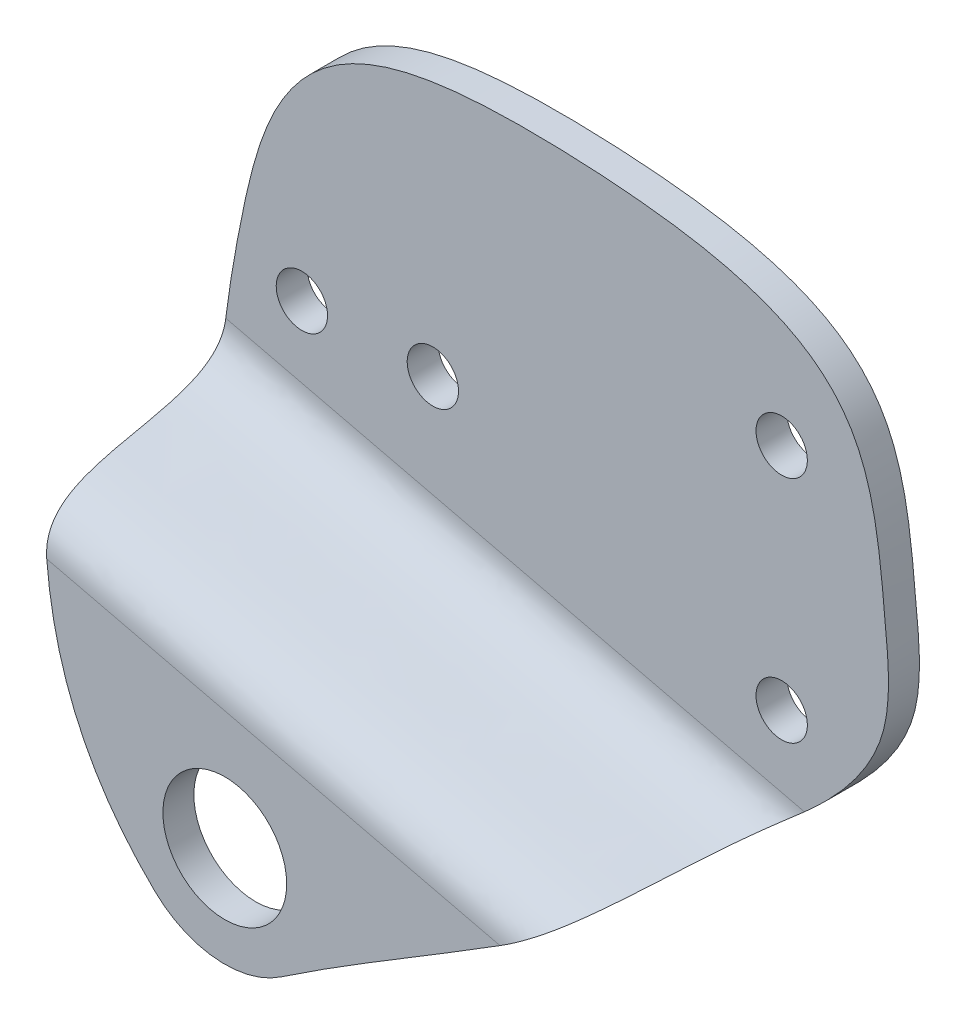
ISO-10303-21;
HEADER;
FILE_DESCRIPTION(('STEP AP214'),'2;1');
FILE_NAME('part.step','',(''),(''),'','','');
FILE_SCHEMA(('AUTOMOTIVE_DESIGN { 1 0 10303 214 1 1 1 1 }'));
ENDSEC;
DATA;
#1=APPLICATION_CONTEXT('core data for automotive mechanical design processes');
#2=APPLICATION_PROTOCOL_DEFINITION('international standard','automotive_design',2000,#1);
#3=PRODUCT_CONTEXT('',#1,'mechanical');
#4=PRODUCT('Part','Part','',(#3));
#5=PRODUCT_RELATED_PRODUCT_CATEGORY('part','',(#4));
#6=PRODUCT_DEFINITION_FORMATION('','',#4);
#7=PRODUCT_DEFINITION_CONTEXT('part definition',#1,'design');
#8=PRODUCT_DEFINITION('design','',#6,#7);
#9=PRODUCT_DEFINITION_SHAPE('','',#8);
#10=(LENGTH_UNIT() NAMED_UNIT(*) SI_UNIT(.MILLI.,.METRE.));
#11=(NAMED_UNIT(*) PLANE_ANGLE_UNIT() SI_UNIT($,.RADIAN.));
#12=(NAMED_UNIT(*) SI_UNIT($,.STERADIAN.) SOLID_ANGLE_UNIT());
#13=UNCERTAINTY_MEASURE_WITH_UNIT(LENGTH_MEASURE(1.E-05),#10,'distance_accuracy_value','');
#14=(GEOMETRIC_REPRESENTATION_CONTEXT(3) GLOBAL_UNCERTAINTY_ASSIGNED_CONTEXT((#13)) GLOBAL_UNIT_ASSIGNED_CONTEXT((#10,
#11,#12)) REPRESENTATION_CONTEXT('',''));
#15=CARTESIAN_POINT('',(0.,0.,0.));
#16=DIRECTION('',(0.,0.,1.));
#17=DIRECTION('',(1.,0.,0.));
#18=AXIS2_PLACEMENT_3D('',#15,#16,#17);
#19=CARTESIAN_POINT('',(-6.75827311296111,-14.3276770365907,20.));
#20=CARTESIAN_POINT('',(-19.8154079035087,-1.77108365191892,20.));
#21=CARTESIAN_POINT('',(-17.8680940726573,18.374574848412,20.));
#22=CARTESIAN_POINT('',(-11.5593956936098,47.1138850064545,20.));
#23=CARTESIAN_POINT('',(0.771302016072701,51.6536949529489,20.));
#24=CARTESIAN_POINT('',(45.1342229676761,49.0484343886684,20.));
#25=CARTESIAN_POINT('',(46.0113162890516,37.2911359933891,20.));
#26=CARTESIAN_POINT('',(48.8462304394248,7.87308757883785,20.));
#27=CARTESIAN_POINT('',(21.9825403796663,-4.18951904205312,20.));
#28=CARTESIAN_POINT('',(5.46679546409183,-15.3732055191096,20.));
#29=B_SPLINE_CURVE_WITH_KNOTS('',3,(#19,#20,#21,#22,#23,#24,#25,#26,#27,#28),.UNSPECIFIED.,.F.,
.F.,(4,1,1,1,1,1,1,4),(0.,0.179468051465904,0.221834172396024,0.401235982978407,
0.455769682109186,0.712637464573034,0.770271343642914,1.),.UNSPECIFIED.);
#30=DIRECTION('',(0.,0.,-1.));
#31=VECTOR('',#30,1.);
#32=SURFACE_OF_LINEAR_EXTRUSION('',#29,#31);
#33=CARTESIAN_POINT('',(-17.1576461110458,7.23100151822922,17.));
#34=CARTESIAN_POINT('',(-17.1600373098258,7.25330435248548,17.0000178031605));
#35=CARTESIAN_POINT('',(-17.162409159117,7.27559563335837,16.998784301204));
#36=CARTESIAN_POINT('',(-17.1670865979264,7.31987833822628,16.9939688079371));
#37=CARTESIAN_POINT('',(-17.1693923308647,7.34187034663965,16.9903923769404));
#38=CARTESIAN_POINT('',(-17.1738786422944,7.38497365658473,16.9811322626733));
#39=CARTESIAN_POINT('',(-17.1760607634072,7.40609374878556,16.9754897332528));
#40=CARTESIAN_POINT('',(-17.1803345080112,7.44774867071633,16.9623127043894));
#41=CARTESIAN_POINT('',(-17.1824260735081,7.46828312259538,16.9547770129257));
#42=CARTESIAN_POINT('',(-17.1897558955757,7.5407409830544,16.9247665724802));
#43=CARTESIAN_POINT('',(-17.1947212157618,7.59077107133713,16.8975600834334));
#44=CARTESIAN_POINT('',(-17.2017077113564,7.6622970911833,16.8512196679418));
#45=CARTESIAN_POINT('',(-17.2039687306374,7.68564943471247,16.8347645100948));
#46=CARTESIAN_POINT('',(-17.2083474143693,7.7312359683866,16.8003423391896));
#47=CARTESIAN_POINT('',(-17.2104650931944,7.75347027059149,16.7823754781321));
#48=CARTESIAN_POINT('',(-17.2177049225561,7.83006798652348,16.7168872024302));
#49=CARTESIAN_POINT('',(-17.2224794962828,7.88167347589056,16.6661119400432));
#50=CARTESIAN_POINT('',(-17.2314112756843,7.97988638193276,16.5598605843504));
#51=CARTESIAN_POINT('',(-17.2355672240998,8.02648356803469,16.5043752682839));
#52=CARTESIAN_POINT('',(-17.2434201274369,8.11598073250213,16.3901219414568));
#53=CARTESIAN_POINT('',(-17.2471151076446,8.15886457887969,16.331341272746));
#54=CARTESIAN_POINT('',(-17.254127264878,8.24153479610629,16.2117344206324));
#55=CARTESIAN_POINT('',(-17.2574448264314,8.28132430625411,16.1509104024346));
#56=CARTESIAN_POINT('',(-17.2652199074282,8.37599407327627,15.9998213174517));
#57=CARTESIAN_POINT('',(-17.2695121926573,8.42953581781948,15.9087126725229));
#58=CARTESIAN_POINT('',(-17.2776265464514,8.53288246050805,15.7243676372868));
#59=CARTESIAN_POINT('',(-17.281448453024,8.58268606899698,15.6311305269958));
#60=CARTESIAN_POINT('',(-17.2887300304185,8.67952948449885,15.4429726097941));
#61=CARTESIAN_POINT('',(-17.2921889086396,8.72656314957593,15.3480486270549));
#62=CARTESIAN_POINT('',(-17.2988059774584,8.81838097573991,15.1571051631543));
#63=CARTESIAN_POINT('',(-17.3019641427025,8.86316494700127,15.0610855903848));
#64=CARTESIAN_POINT('',(-17.3110737703264,8.99495489772294,14.7715985552958));
#65=CARTESIAN_POINT('',(-17.3166526960266,9.0792958453852,14.5769087255384));
#66=CARTESIAN_POINT('',(-17.3270926655446,9.24347587673956,14.1853560817418));
#67=CARTESIAN_POINT('',(-17.3319527795949,9.32330904866101,13.9884908012882));
#68=CARTESIAN_POINT('',(-17.3410958839933,9.47978541883292,13.5938347245058));
#69=CARTESIAN_POINT('',(-17.3453797413679,9.55643328678098,13.3960457925836));
#70=CARTESIAN_POINT('',(-17.3534778935976,9.70770714752569,12.9998061160096));
#71=CARTESIAN_POINT('',(-17.3572924257588,9.78233414712837,12.8013557583671));
#72=CARTESIAN_POINT('',(-17.3644166438383,9.92826798099371,12.4097228711362));
#73=CARTESIAN_POINT('',(-17.367737698625,9.9996085606063,12.2165530844254));
#74=CARTESIAN_POINT('',(-17.3740418972421,10.1417342650718,11.8300034956042));
#75=CARTESIAN_POINT('',(-17.3770250396144,10.2125193875268,11.6366236925912));
#76=CARTESIAN_POINT('',(-17.385513690571,10.424835518141,11.0562359637629));
#77=CARTESIAN_POINT('',(-17.3905548558369,10.5662539206519,10.6691797887427));
#78=CARTESIAN_POINT('',(-17.3995049890679,10.8519346545281,9.89595580643819));
#79=CARTESIAN_POINT('',(-17.4034135899093,10.9961978919055,9.5097883273784));
#80=CARTESIAN_POINT('',(-17.4100743076939,11.2897039103176,8.74081908783941));
#81=CARTESIAN_POINT('',(-17.4128302872911,11.4389282208481,8.35801036403878));
#82=CARTESIAN_POINT('',(-17.4171037021398,11.7454482929611,7.59572705162868));
#83=CARTESIAN_POINT('',(-17.4186214564127,11.9027419644128,7.21625162915467));
#84=CARTESIAN_POINT('',(-17.4202229276538,12.2283588719653,6.46214354195705));
#85=CARTESIAN_POINT('',(-17.4203070936521,12.3966786378779,6.08750939758239));
#86=CARTESIAN_POINT('',(-17.4190568723475,12.6726235692408,5.50447711744415));
#87=CARTESIAN_POINT('',(-17.4183157573985,12.775296353606,5.29373518419097));
#88=CARTESIAN_POINT('',(-17.4161724162553,12.9862744754258,4.87506564584575));
#89=CARTESIAN_POINT('',(-17.4147701526028,13.0945801317086,4.66713820089884));
#90=CARTESIAN_POINT('',(-17.411191080342,13.3180680379784,4.2543059418259));
#91=CARTESIAN_POINT('',(-17.4090122738401,13.4332673819302,4.04941035767673));
#92=CARTESIAN_POINT('',(-17.4037388054737,13.6714403649219,3.64419322599506));
#93=CARTESIAN_POINT('',(-17.4006442014773,13.7944135123591,3.44387139031447));
#94=CARTESIAN_POINT('',(-17.3933206888617,14.0507530398545,3.04724661735366));
#95=CARTESIAN_POINT('',(-17.3890812109081,14.1842076016576,2.85100046882114));
#96=CARTESIAN_POINT('',(-17.3792348641996,14.4622299260666,2.46640324447343));
#97=CARTESIAN_POINT('',(-17.3736274902082,14.6068017813368,2.27805511600767));
#98=CARTESIAN_POINT('',(-17.3607477388921,14.9085662788378,1.9126906588289));
#99=CARTESIAN_POINT('',(-17.3534807002069,15.065717426705,1.73564027578168));
#100=CARTESIAN_POINT('',(-17.3368836804853,15.3950345755347,1.3964112832851));
#101=CARTESIAN_POINT('',(-17.3275558962753,15.5671844698345,1.23421709514214));
#102=CARTESIAN_POINT('',(-17.3061703370653,15.9318454546632,0.927595605025775));
#103=CARTESIAN_POINT('',(-17.2940700975037,16.1246453898254,0.783505224709323));
#104=CARTESIAN_POINT('',(-17.2735853475489,16.4276839525698,0.589406877136833));
#105=CARTESIAN_POINT('',(-17.2663687010225,16.5309944597746,0.528384286401697));
#106=CARTESIAN_POINT('',(-17.2511095070699,16.7420998854735,0.414834662435587));
#107=CARTESIAN_POINT('',(-17.2430674085647,16.8498923476835,0.362303051003599));
#108=CARTESIAN_POINT('',(-17.2271481895412,17.0564086578921,0.272607204825161));
#109=CARTESIAN_POINT('',(-17.2193672181201,17.1546671930775,0.234355121229615));
#110=CARTESIAN_POINT('',(-17.2031513233609,17.3539046098518,0.16604078850934));
#111=CARTESIAN_POINT('',(-17.1947167075721,17.4548821976671,0.135974717440806));
#112=CARTESIAN_POINT('',(-17.1772281348188,17.6588548122114,0.0846124476623503));
#113=CARTESIAN_POINT('',(-17.1681749897405,17.7618470723157,0.0633050007645057));
#114=CARTESIAN_POINT('',(-17.149491519569,17.9692062403423,0.0297535932537314));
#115=CARTESIAN_POINT('',(-17.13986151421,18.0735723622018,0.0175046611489352));
#116=CARTESIAN_POINT('',(-17.1257623249731,18.2228613758646,0.00652773893878656));
#117=CARTESIAN_POINT('',(-17.1214999714265,18.2675565826294,0.00407412104943583));
#118=CARTESIAN_POINT('',(-17.1128928856601,18.3569518854992,0.000810933716124633));
#119=CARTESIAN_POINT('',(-17.1085482443186,18.4016519275381,-3.53554955336286E-07));
#120=CARTESIAN_POINT('',(-17.1041628237642,18.4463530205361,0.));
#121=B_SPLINE_CURVE_WITH_KNOTS('',3,(#33,#34,#35,#36,#37,#38,#39,#40,#41,#42,#43,#44,#45,#46,
#47,#48,#49,#50,#51,#52,#53,#54,#55,#56,#57,#58,#59,#60,#61,#62,#63,#64,#65,#66,#67,#68,#69,#70,
#71,#72,#73,#74,#75,#76,#77,#78,#79,#80,#81,#82,#83,#84,#85,#86,#87,#88,#89,#90,#91,#92,#93,#94,
#95,#96,#97,#98,#99,#100,#101,#102,#103,#104,#105,#106,#107,#108,#109,#110,#111,#112,#113,#114,
#115,#116,#117,#118,#119,#120),.UNSPECIFIED.,.F.,.F.,(4,2,2,2,2,2,2,2,2,2,2,2,2,2,2,2,2,2,2,2,2,
2,2,2,2,2,2,2,2,2,2,2,2,2,2,2,2,2,2,2,2,2,2,4),(0.,0.0672364929255108,0.134313993336494,
0.200122255994407,0.265972058835482,0.436306319023202,0.522249157605836,0.608183365001543,
0.825278331961028,1.04280865699906,1.26124099012646,1.47944874484486,1.79660296814019,
2.11386611140387,2.43180812533647,2.74977692179813,3.38640529072114,4.02385005532101,
4.66032473931559,5.29647626654956,5.91432174685583,6.53216989298245,7.76850556978192,
9.00524156091912,10.2377991445134,11.4700390665919,12.7018930180295,13.4050959008011,
14.1083386292184,14.8134038823316,15.5184245927807,16.2301906846008,16.9422200684758,
17.6519905477358,18.3610080069761,19.0817123129171,19.4420070052742,19.8021067797175,
20.1189659820671,20.4356769922585,20.7519799886643,21.0681092626485,21.202979716165,
21.3377090263092),.UNSPECIFIED.);
#122=CARTESIAN_POINT('',(-17.1576461110457,7.23100151822918,17.));
#123=VERTEX_POINT('',#122);
#124=CARTESIAN_POINT('',(-17.1041628252776,18.4463530051091,0.));
#125=VERTEX_POINT('',#124);
#126=EDGE_CURVE('E128',#123,#125,#121,.T.);
#127=ORIENTED_EDGE('',*,*,#126,.F.);
#128=CARTESIAN_POINT('',(-6.75827311296111,-14.3276770365907,17.));
#129=CARTESIAN_POINT('',(-19.8154079035087,-1.77108365191892,17.));
#130=CARTESIAN_POINT('',(-17.8680940726573,18.374574848412,17.));
#131=CARTESIAN_POINT('',(-11.5593956936098,47.1138850064545,17.));
#132=CARTESIAN_POINT('',(0.771302016072701,51.6536949529489,17.));
#133=CARTESIAN_POINT('',(45.1342229676761,49.0484343886684,17.));
#134=CARTESIAN_POINT('',(46.0113162890516,37.2911359933891,17.));
#135=CARTESIAN_POINT('',(48.8462304394248,7.87308757883785,17.));
#136=CARTESIAN_POINT('',(21.9825403796663,-4.18951904205312,17.));
#137=CARTESIAN_POINT('',(5.46679546409183,-15.3732055191096,17.));
#138=B_SPLINE_CURVE_WITH_KNOTS('',3,(#128,#129,#130,#131,#132,#133,#134,#135,#136,#137),
.UNSPECIFIED.,.F.,.F.,(4,1,1,1,1,1,1,4),(0.,0.179468051465904,0.221834172396024,
0.401235982978407,0.455769682109186,0.712637464573034,0.770271343642914,1.),.UNSPECIFIED.);
#139=CARTESIAN_POINT('',(-6.75827311296123,-14.3276770365908,17.));
#140=VERTEX_POINT('',#139);
#141=EDGE_CURVE('E160',#140,#123,#138,.T.);
#142=ORIENTED_EDGE('',*,*,#141,.F.);
#143=DIRECTION('',(0.,0.,-1.));
#144=VECTOR('',#143,1.);
#145=CARTESIAN_POINT('',(-6.75827311296123,-14.3276770365908,20.));
#146=LINE('',#145,#144);
#147=CARTESIAN_POINT('',(-6.75827311296123,-14.3276770365908,20.));
#148=VERTEX_POINT('',#147);
#149=EDGE_CURVE('E292',#148,#140,#146,.T.);
#150=ORIENTED_EDGE('',*,*,#149,.F.);
#151=CARTESIAN_POINT('',(-17.2638410833439,8.35941955439843,20.));
#152=VERTEX_POINT('',#151);
#153=EDGE_CURVE('E229',#148,#152,#29,.T.);
#154=ORIENTED_EDGE('',*,*,#153,.T.);
#155=CARTESIAN_POINT('',(-17.263841083344,8.359419554399,20.));
#156=CARTESIAN_POINT('',(-17.2709901330039,8.44740885837508,19.9999999052435));
#157=CARTESIAN_POINT('',(-17.2778801463331,8.53543280712144,19.9982255486954));
#158=CARTESIAN_POINT('',(-17.2911477527138,8.71149720381179,19.9908407657933));
#159=CARTESIAN_POINT('',(-17.2975245138844,8.79953745559717,19.9852242466249));
#160=CARTESIAN_POINT('',(-17.309751327558,8.97534124803686,19.9698622493218));
#161=CARTESIAN_POINT('',(-17.3156011358648,9.06310464239794,19.9601148687116));
#162=CARTESIAN_POINT('',(-17.3267926449205,9.23845130351306,19.9361663447146));
#163=CARTESIAN_POINT('',(-17.3321320101515,9.32603210138215,19.9219458981691));
#164=CARTESIAN_POINT('',(-17.3422717284533,9.50030206138337,19.8888203793706));
#165=CARTESIAN_POINT('',(-17.3470723163608,9.58699159690484,19.8699173597215));
#166=CARTESIAN_POINT('',(-17.3561408536287,9.75917213738511,19.827223721746));
#167=CARTESIAN_POINT('',(-17.3604088751337,9.84466330328639,19.8034337665909));
#168=CARTESIAN_POINT('',(-17.3704813155103,10.0576500824307,19.7372853165422));
#169=CARTESIAN_POINT('',(-17.3759490757443,10.1841693045885,19.6916652715869));
#170=CARTESIAN_POINT('',(-17.3857454955633,10.4323980834775,19.588689696854));
#171=CARTESIAN_POINT('',(-17.3900740529609,10.5541072079074,19.5313331151195));
#172=CARTESIAN_POINT('',(-17.3976717622672,10.791079278545,19.4054381059569));
#173=CARTESIAN_POINT('',(-17.4009446290804,10.9063636213201,19.3369401934255));
#174=CARTESIAN_POINT('',(-17.4065717590854,11.1299871570263,19.1894121344428));
#175=CARTESIAN_POINT('',(-17.4089260629779,11.2383266574997,19.1103824548532));
#176=CARTESIAN_POINT('',(-17.4126483305413,11.4365421865904,18.9516809710617));
#177=CARTESIAN_POINT('',(-17.4140936303445,11.527164780101,18.8729383616834));
#178=CARTESIAN_POINT('',(-17.4164584060228,11.7022422661607,18.7088413572349));
#179=CARTESIAN_POINT('',(-17.4173776957207,11.7866949657092,18.6234846332716));
#180=CARTESIAN_POINT('',(-17.419494867155,12.0310763938315,18.3586778750189));
#181=CARTESIAN_POINT('',(-17.4200483781871,12.1818083066498,18.1706718814338));
#182=CARTESIAN_POINT('',(-17.4200813765346,12.4565641555857,17.7851235858223));
#183=CARTESIAN_POINT('',(-17.4195933333757,12.5812662766288,17.588051620833));
#184=CARTESIAN_POINT('',(-17.4180131039659,12.8130561870536,17.1836754047876));
#185=CARTESIAN_POINT('',(-17.4169203285281,12.9201266658127,16.9763613546104));
#186=CARTESIAN_POINT('',(-17.4143869057941,13.1199745944452,16.5543447672428));
#187=CARTESIAN_POINT('',(-17.4129452837611,13.2127107806295,16.3396229989726));
#188=CARTESIAN_POINT('',(-17.4098746939165,13.3863839501887,15.9056018383214));
#189=CARTESIAN_POINT('',(-17.4082457878958,13.4673248053321,15.6863039751676));
#190=CARTESIAN_POINT('',(-17.4046345681185,13.6315651307681,15.210729308076));
#191=CARTESIAN_POINT('',(-17.4026363144118,13.7133306671732,14.9539283472152));
#192=CARTESIAN_POINT('',(-17.3985790901159,13.8676020665026,14.4375647245286));
#193=CARTESIAN_POINT('',(-17.39652011114,13.940106642956,14.1780016844266));
#194=CARTESIAN_POINT('',(-17.3923633437702,14.0783328431323,13.6574519397762));
#195=CARTESIAN_POINT('',(-17.3902656083948,14.1440630255818,13.3964674813111));
#196=CARTESIAN_POINT('',(-17.3860168616526,14.271049245692,12.8734092395373));
#197=CARTESIAN_POINT('',(-17.3838658471427,14.3323050185398,12.6113353927229));
#198=CARTESIAN_POINT('',(-17.3793062970911,14.4569449954305,12.0663168321682));
#199=CARTESIAN_POINT('',(-17.376890714594,14.5201270727151,11.7833264635223));
#200=CARTESIAN_POINT('',(-17.3718886789004,14.6458766778324,11.2171921845962));
#201=CARTESIAN_POINT('',(-17.3693022139459,14.7084441630358,10.9340482650829));
#202=CARTESIAN_POINT('',(-17.36386004571,14.8352677746027,10.3680332919399));
#203=CARTESIAN_POINT('',(-17.3610042488781,14.8995244820745,10.0851623678542));
#204=CARTESIAN_POINT('',(-17.3548961381887,15.0320236052593,9.52084287110751));
#205=CARTESIAN_POINT('',(-17.3516444933247,15.1002591975774,9.23939271337863));
#206=CARTESIAN_POINT('',(-17.3445597098224,15.2435230433432,8.67829983660063));
#207=CARTESIAN_POINT('',(-17.3407267380415,15.3185493451813,8.39865662284378));
#208=CARTESIAN_POINT('',(-17.3322272543212,15.478624536987,7.84234494364695));
#209=CARTESIAN_POINT('',(-17.3275611522391,15.5636684918154,7.56567508610243));
#210=CARTESIAN_POINT('',(-17.3193513605236,15.7072116179825,7.1381920797426));
#211=CARTESIAN_POINT('',(-17.3162216863163,15.7608528112003,6.98574362504213));
#212=CARTESIAN_POINT('',(-17.3094988196666,15.8734186269848,6.68279526003929));
#213=CARTESIAN_POINT('',(-17.3059055996597,15.932343563683,6.53229546619914));
#214=CARTESIAN_POINT('',(-17.2981410920958,16.0565999425728,6.23354154158931));
#215=CARTESIAN_POINT('',(-17.2939684546712,16.1219462375367,6.08529357854258));
#216=CARTESIAN_POINT('',(-17.2849191931253,16.2600578538085,5.79228933603395));
#217=CARTESIAN_POINT('',(-17.2800425733124,16.3328231297095,5.64753303520851));
#218=CARTESIAN_POINT('',(-17.2693453427755,16.488164604227,5.36060974725546));
#219=CARTESIAN_POINT('',(-17.2635118912955,16.570869470858,5.21851225637763));
#220=CARTESIAN_POINT('',(-17.2507499665615,16.7466203649061,4.94081070957183));
#221=CARTESIAN_POINT('',(-17.2438213063118,16.8396681574652,4.80520776768275));
#222=CARTESIAN_POINT('',(-17.228671205935,17.0370073959538,4.54329818191966));
#223=CARTESIAN_POINT('',(-17.2204550843917,17.1412520529903,4.41695629967882));
#224=CARTESIAN_POINT('',(-17.2024794461198,17.3622074708707,4.17581819241292));
#225=CARTESIAN_POINT('',(-17.1927211423129,17.4789084116644,4.06101300892821));
#226=CARTESIAN_POINT('',(-17.1751265382449,17.6825948809151,3.88303391263471));
#227=CARTESIAN_POINT('',(-17.1677838863523,17.7659919664977,3.81568476544063));
#228=CARTESIAN_POINT('',(-17.1523180161695,17.9380033043471,3.68813440805212));
#229=CARTESIAN_POINT('',(-17.1441950359366,18.0266159623076,3.62793103032582));
#230=CARTESIAN_POINT('',(-17.1271576248848,18.2086237035583,3.51541168434169));
#231=CARTESIAN_POINT('',(-17.1182433561349,18.3020178058785,3.46309410683662));
#232=CARTESIAN_POINT('',(-17.09963697966,18.4929656798255,3.3668581658777));
#233=CARTESIAN_POINT('',(-17.0899448685449,18.5905194695805,3.32293983903324));
#234=CARTESIAN_POINT('',(-17.0698356449904,18.7888743127413,3.24380549152374));
#235=CARTESIAN_POINT('',(-17.0594194474227,18.8896711850347,3.20857873642884));
#236=CARTESIAN_POINT('',(-17.0379090710301,19.0937969308884,3.14671261912945));
#237=CARTESIAN_POINT('',(-17.0268148188104,19.1971260778225,3.12007418851837));
#238=CARTESIAN_POINT('',(-17.004015370288,19.4055261966643,3.07508304180289));
#239=CARTESIAN_POINT('',(-16.9923099688868,19.5105977451347,3.05673312747926));
#240=CARTESIAN_POINT('',(-16.9683618926473,19.7217458989299,3.02783938409987));
#241=CARTESIAN_POINT('',(-16.9561191897928,19.8278225564367,3.01729596260596));
#242=CARTESIAN_POINT('',(-16.9373337053934,19.9878438887513,3.00684154309595));
#243=CARTESIAN_POINT('',(-16.9309633783707,20.0416506657827,3.00425108365614));
#244=CARTESIAN_POINT('',(-16.9181278219332,20.149167162803,3.00083273966485));
#245=CARTESIAN_POINT('',(-16.9116628826635,20.2028767709273,3.00000028534884));
#246=CARTESIAN_POINT('',(-16.9051459020542,20.2565820707547,3.));
#247=B_SPLINE_CURVE_WITH_KNOTS('',3,(#155,#156,#157,#158,#159,#160,#161,#162,#163,#164,#165,
#166,#167,#168,#169,#170,#171,#172,#173,#174,#175,#176,#177,#178,#179,#180,#181,#182,#183,#184,
#185,#186,#187,#188,#189,#190,#191,#192,#193,#194,#195,#196,#197,#198,#199,#200,#201,#202,#203,
#204,#205,#206,#207,#208,#209,#210,#211,#212,#213,#214,#215,#216,#217,#218,#219,#220,#221,#222,
#223,#224,#225,#226,#227,#228,#229,#230,#231,#232,#233,#234,#235,#236,#237,#238,#239,#240,#241,
#242,#243,#244,#245,#246),.UNSPECIFIED.,.F.,.F.,(4,2,2,2,2,2,2,2,2,2,2,2,2,2,2,2,2,2,2,2,2,2,2,
2,2,2,2,2,2,2,2,2,2,2,2,2,2,2,2,2,2,2,2,2,2,4),(0.,0.264839747923234,0.530100449257866,
0.795483449867664,1.06202777553312,1.32845546771346,1.59484702873198,1.99804910454771,
2.40128733559294,2.8030907130894,3.20487628500227,3.56469707078987,3.92464513371195,
4.6453875971816,5.34399032441119,6.04327489755146,6.74453642313028,7.44556724152173,
8.25385757474242,9.06226006844533,9.8696283781439,10.6770444323991,11.546943365803,
12.416902217024,13.2871643630024,14.1559756458255,15.024538025507,15.8926742885221,
16.3775187175037,16.8623919908177,17.3484144398751,17.8344339144757,18.3276087299418,
18.8208678410925,19.3121405250001,19.8030287299007,20.1250453534169,20.4469640483951,
20.7688169605518,21.0906712755203,21.4121260754355,21.7336157324984,22.0552139820591,
22.3768290204565,22.5395383055772,22.7018241203803),.UNSPECIFIED.);
#248=CARTESIAN_POINT('',(-16.9051459020541,20.2565820707547,3.));
#249=VERTEX_POINT('',#248);
#250=EDGE_CURVE('E120',#152,#249,#247,.T.);
#251=ORIENTED_EDGE('',*,*,#250,.T.);
#252=CARTESIAN_POINT('',(-6.75827311296111,-14.3276770365907,2.99999999999999));
#253=CARTESIAN_POINT('',(-19.8154079035087,-1.77108365191892,2.99999999999999));
#254=CARTESIAN_POINT('',(-17.8680940726573,18.374574848412,2.99999999999999));
#255=CARTESIAN_POINT('',(-11.5593956936098,47.1138850064545,2.99999999999999));
#256=CARTESIAN_POINT('',(0.771302016072701,51.6536949529489,2.99999999999999));
#257=CARTESIAN_POINT('',(45.1342229676761,49.0484343886684,2.99999999999999));
#258=CARTESIAN_POINT('',(46.0113162890516,37.2911359933891,2.99999999999999));
#259=CARTESIAN_POINT('',(48.8462304394248,7.87308757883785,2.99999999999999));
#260=CARTESIAN_POINT('',(21.9825403796663,-4.18951904205312,2.99999999999999));
#261=CARTESIAN_POINT('',(5.46679546409183,-15.3732055191096,2.99999999999999));
#262=B_SPLINE_CURVE_WITH_KNOTS('',3,(#252,#253,#254,#255,#256,#257,#258,#259,#260,#261),
.UNSPECIFIED.,.F.,.F.,(4,1,1,1,1,1,1,4),(0.,0.179468051465904,0.221834172396024,
0.401235982978407,0.455769682109186,0.712637464573034,0.770271343642914,1.),.UNSPECIFIED.);
#263=CARTESIAN_POINT('',(39.2043888585068,6.85481517066375,3.));
#264=VERTEX_POINT('',#263);
#265=EDGE_CURVE('E225',#249,#264,#262,.T.);
#266=ORIENTED_EDGE('',*,*,#265,.T.);
#267=CARTESIAN_POINT('',(39.2043888585067,6.85481517066375,3.));
#268=CARTESIAN_POINT('',(39.1058589982499,6.76818237665127,2.99999954563905));
#269=CARTESIAN_POINT('',(39.0069610175781,6.68191515204719,3.00330890376477));
#270=CARTESIAN_POINT('',(38.8085171519883,6.5101212394353,3.01713995662445));
#271=CARTESIAN_POINT('',(38.7089702150659,6.42459751381202,3.02768305449465));
#272=CARTESIAN_POINT('',(38.5098168371932,6.25474120540509,3.05659425825737));
#273=CARTESIAN_POINT('',(38.4102104239283,6.17040977071121,3.07496943749171));
#274=CARTESIAN_POINT('',(38.2115074021414,6.00334369573381,3.12008867506326));
#275=CARTESIAN_POINT('',(38.1124108927566,5.92060935795456,3.14683430264102));
#276=CARTESIAN_POINT('',(37.9154182283346,5.75722432931625,3.20911715398937));
#277=CARTESIAN_POINT('',(37.8175210210731,5.67657173114326,3.24464599005159));
#278=CARTESIAN_POINT('',(37.6235463580703,5.51775635057986,3.32478879300448));
#279=CARTESIAN_POINT('',(37.5274677895227,5.43959202426972,3.36939699407179));
#280=CARTESIAN_POINT('',(37.3237322702869,5.27480719709148,3.47510828047263));
#281=CARTESIAN_POINT('',(37.2164604867233,5.18864229780201,3.53767438349001));
#282=CARTESIAN_POINT('',(37.0061541347688,5.02075090339338,3.6747511871772));
#283=CARTESIAN_POINT('',(36.9031197054571,4.93902455392898,3.74926227951526));
#284=CARTESIAN_POINT('',(36.7025388184318,4.78081434354588,3.90931708844501));
#285=CARTESIAN_POINT('',(36.6049740198151,4.70431274774394,3.99482031798131));
#286=CARTESIAN_POINT('',(36.4155893434944,4.55656393111258,4.17609221979359));
#287=CARTESIAN_POINT('',(36.3237699079817,4.48531711464151,4.27186168067375));
#288=CARTESIAN_POINT('',(36.1249342345548,4.33173282186317,4.49656953507762));
#289=CARTESIAN_POINT('',(36.0195617861788,4.25083918242132,4.62795116591431));
#290=CARTESIAN_POINT('',(35.8183414025367,4.09711665616422,4.90222931503991));
#291=CARTESIAN_POINT('',(35.7224976004516,4.02429126751043,5.04513078196809));
#292=CARTESIAN_POINT('',(35.5396115580212,3.88591909598977,5.34060160861463));
#293=CARTESIAN_POINT('',(35.4526032507256,3.82040028629082,5.49320483315407));
#294=CARTESIAN_POINT('',(35.2870826291469,3.69622519188778,5.80543594576017));
#295=CARTESIAN_POINT('',(35.2085646856606,3.63756435815091,5.96505907954887));
#296=CARTESIAN_POINT('',(35.0565175197276,3.52434177951387,6.29518076399836));
#297=CARTESIAN_POINT('',(34.983242542093,3.46998240740498,6.46586448502245));
#298=CARTESIAN_POINT('',(34.843578490426,3.36668063449285,6.81165827257325));
#299=CARTESIAN_POINT('',(34.7771914268142,3.31773981495991,6.98676961297367));
#300=CARTESIAN_POINT('',(34.650099523525,3.22429576475516,7.340725362856));
#301=CARTESIAN_POINT('',(34.5894097485162,3.17980427974234,7.51957822048752));
#302=CARTESIAN_POINT('',(34.4729071326675,3.09460111587711,7.8797198364909));
#303=CARTESIAN_POINT('',(34.4170938606078,3.05388910279337,8.06100837784093));
#304=CARTESIAN_POINT('',(34.3091771453938,2.97534279202231,8.426192092285));
#305=CARTESIAN_POINT('',(34.2570909981041,2.93752186133024,8.61009519870284));
#306=CARTESIAN_POINT('',(34.1560385468491,2.86429417063697,8.97923940807207));
#307=CARTESIAN_POINT('',(34.107072440801,2.8288875637763,9.16448059507522));
#308=CARTESIAN_POINT('',(33.9635068330011,2.72527193520225,9.72216078153556));
#309=CARTESIAN_POINT('',(33.8724007347216,2.65978389561249,10.0959931190526));
#310=CARTESIAN_POINT('',(33.6930784331178,2.53131991514654,10.847541211887));
#311=CARTESIAN_POINT('',(33.6048865257871,2.46836444059202,11.2252659590387));
#312=CARTESIAN_POINT('',(33.4268012037889,2.34166888914752,11.9789114865975));
#313=CARTESIAN_POINT('',(33.3369139803175,2.27793188560073,12.3548342125228));
#314=CARTESIAN_POINT('',(33.1497933885727,2.14571736083692,13.1030221262172));
#315=CARTESIAN_POINT('',(33.052579834498,2.07725266501549,13.4752943055013));
#316=CARTESIAN_POINT('',(32.8964704343197,1.96774014359687,14.0293823351931));
#317=CARTESIAN_POINT('',(32.8427334512316,1.93011004320967,14.213314067861));
#318=CARTESIAN_POINT('',(32.7309497758972,1.85199125615289,14.5792430425594));
#319=CARTESIAN_POINT('',(32.6729034572446,1.81150281729911,14.7612404507241));
#320=CARTESIAN_POINT('',(32.5434533971772,1.72140438110341,15.1468474925579));
#321=CARTESIAN_POINT('',(32.4713013714497,1.67129857844392,15.3500935376562));
#322=CARTESIAN_POINT('',(32.3187313728816,1.56563068257376,15.7522207498646));
#323=CARTESIAN_POINT('',(32.2383078413608,1.51006492125359,15.9510988712393));
#324=CARTESIAN_POINT('',(32.0678098774498,1.39261006572053,16.3424236693091));
#325=CARTESIAN_POINT('',(31.9777502941382,1.33073070734977,16.5348796587194));
#326=CARTESIAN_POINT('',(31.7863665785248,1.19965116621456,16.9115192457862));
#327=CARTESIAN_POINT('',(31.6850464450849,1.13045358272809,17.0957057476982));
#328=CARTESIAN_POINT('',(31.4889540230543,0.996993889009101,17.4214126732986));
#329=CARTESIAN_POINT('',(31.3962230614508,0.934043462968302,17.5646945176204));
#330=CARTESIAN_POINT('',(31.2017324986043,0.802409109676706,17.8422513986891));
#331=CARTESIAN_POINT('',(31.0999734684958,0.733725545132548,17.9765270042471));
#332=CARTESIAN_POINT('',(30.8875393242932,0.590792438135943,18.2339707254594));
#333=CARTESIAN_POINT('',(30.7768894360187,0.516558682047841,18.3571683023417));
#334=CARTESIAN_POINT('',(30.5466868836583,0.362622970548725,18.5912343271706));
#335=CARTESIAN_POINT('',(30.4271345920535,0.282921243931468,18.7021032904696));
#336=CARTESIAN_POINT('',(30.1794538278894,0.118352622429513,18.9105287794032));
#337=CARTESIAN_POINT('',(30.0513007733903,0.0334709914807831,19.0080444955037));
#338=CARTESIAN_POINT('',(29.7878189997151,-0.140455086998638,19.1885920752384));
#339=CARTESIAN_POINT('',(29.6524899305361,-0.229499737551339,19.2716232315538));
#340=CARTESIAN_POINT('',(29.3752105009267,-0.411334121728058,19.4234470733584));
#341=CARTESIAN_POINT('',(29.2332278400956,-0.504141747316791,19.4921590034434));
#342=CARTESIAN_POINT('',(28.9446948598221,-0.692121028636891,19.6151820357029));
#343=CARTESIAN_POINT('',(28.7981446069907,-0.787292649889114,19.6694933477775));
#344=CARTESIAN_POINT('',(28.5433347883952,-0.952243340801021,19.7512249475094));
#345=CARTESIAN_POINT('',(28.4358660529072,-1.02165641139167,19.7819148781954));
#346=CARTESIAN_POINT('',(28.2195916980273,-1.16103722070797,19.8366955799965));
#347=CARTESIAN_POINT('',(28.1107858765114,-1.2310050427124,19.860785340233));
#348=CARTESIAN_POINT('',(27.8921583839838,-1.3712937386584,19.9028034520837));
#349=CARTESIAN_POINT('',(27.7823362842137,-1.44161475529938,19.92072906886));
#350=CARTESIAN_POINT('',(27.5632439571854,-1.58161533461267,19.9506869139613));
#351=CARTESIAN_POINT('',(27.4539813170236,-1.65129326442321,19.9627828765717));
#352=CARTESIAN_POINT('',(27.2350762307943,-1.79061953021899,19.9818035732039));
#353=CARTESIAN_POINT('',(27.1254340076084,-1.8602678631094,19.9887309494004));
#354=CARTESIAN_POINT('',(26.9060685812167,-1.99935704988516,19.9978230460715));
#355=CARTESIAN_POINT('',(26.7963458005948,-2.06879805694468,19.9999955034623));
#356=CARTESIAN_POINT('',(26.6865809689732,-2.13814229528125,20.));
#357=B_SPLINE_CURVE_WITH_KNOTS('',3,(#267,#268,#269,#270,#271,#272,#273,#274,#275,#276,#277,
#278,#279,#280,#281,#282,#283,#284,#285,#286,#287,#288,#289,#290,#291,#292,#293,#294,#295,#296,
#297,#298,#299,#300,#301,#302,#303,#304,#305,#306,#307,#308,#309,#310,#311,#312,#313,#314,#315,
#316,#317,#318,#319,#320,#321,#322,#323,#324,#325,#326,#327,#328,#329,#330,#331,#332,#333,#334,
#335,#336,#337,#338,#339,#340,#341,#342,#343,#344,#345,#346,#347,#348,#349,#350,#351,#352,#353,
#354,#355,#356),.UNSPECIFIED.,.F.,.F.,(4,2,2,2,2,2,2,2,2,2,2,2,2,2,2,2,2,2,2,2,2,2,2,2,2,2,2,2,
2,2,2,2,2,2,2,2,2,2,2,2,2,2,2,2,4),(0.,0.393608982741111,0.788387623772412,1.18352355690291,
1.57873361212447,1.97356770138883,2.36815183042391,2.82099988325443,3.27386278770972,
3.72510306098243,4.17637802130789,4.73599369829256,5.29585106675944,5.85778315487071,
6.41934036152162,6.99965522789877,7.58013900088491,8.1621168213895,8.74404312652743,
9.32851495203787,9.91302381616618,11.0838323668528,12.262724622069,13.4379261750408,
14.6100561755607,15.1958361284658,15.7815653569091,16.4456025532418,17.1100889534809,
17.7735657441042,18.4368076682973,18.9820685787171,19.5272950193477,20.0710257104116,
20.6147336642637,21.16006785601,21.7054286703951,22.2537865260706,22.8021363885753,
23.1966646589152,23.5912533212614,23.9860168250768,24.3763606363658,24.7665047674379,
25.1560136061751),.UNSPECIFIED.);
#358=CARTESIAN_POINT('',(26.6865809689736,-2.13814229528132,20.));
#359=VERTEX_POINT('',#358);
#360=EDGE_CURVE('E179',#264,#359,#357,.T.);
#361=ORIENTED_EDGE('',*,*,#360,.T.);
#362=CARTESIAN_POINT('',(5.46679546409194,-15.3732055191097,20.));
#363=VERTEX_POINT('',#362);
#364=EDGE_CURVE('E262',#359,#363,#29,.T.);
#365=ORIENTED_EDGE('',*,*,#364,.T.);
#366=DIRECTION('',(0.,0.,-1.));
#367=VECTOR('',#366,1.);
#368=CARTESIAN_POINT('',(5.46679546409194,-15.3732055191097,20.));
#369=LINE('',#368,#367);
#370=CARTESIAN_POINT('',(5.46679546409194,-15.3732055191097,17.));
#371=VERTEX_POINT('',#370);
#372=EDGE_CURVE('E271',#363,#371,#369,.T.);
#373=ORIENTED_EDGE('',*,*,#372,.T.);
#374=CARTESIAN_POINT('',(25.4136795772285,-2.93716305374169,17.));
#375=VERTEX_POINT('',#374);
#376=EDGE_CURVE('E169',#375,#371,#138,.T.);
#377=ORIENTED_EDGE('',*,*,#376,.F.);
#378=CARTESIAN_POINT('',(37.4873225340661,5.4071723426449,0.));
#379=CARTESIAN_POINT('',(37.4210407619202,5.35343969966578,-2.61375466156985E-06));
#380=CARTESIAN_POINT('',(37.3546572440657,5.29984882361738,0.00187479019700125));
#381=CARTESIAN_POINT('',(37.2218091239794,5.1930354078479,0.00941059636197274));
#382=CARTESIAN_POINT('',(37.1553445219986,5.13981286698948,0.0150689868950825));
#383=CARTESIAN_POINT('',(36.9561336936288,4.98092144981755,0.0377332641274651));
#384=CARTESIAN_POINT('',(36.8234486850099,4.87593012540902,0.0604281812883648));
#385=CARTESIAN_POINT('',(36.56078866236,4.66962699175935,0.120397404064958));
#386=CARTESIAN_POINT('',(36.4307998125209,4.56828872638139,0.157522111884808));
#387=CARTESIAN_POINT('',(36.1731153639121,4.36877238591407,0.245649834232212));
#388=CARTESIAN_POINT('',(36.04541996726,4.27059458875218,0.296654065598919));
#389=CARTESIAN_POINT('',(35.7934542615174,4.07810308147,0.411365941067591));
#390=CARTESIAN_POINT('',(35.6691762317624,3.98378037794071,0.475041712117224));
#391=CARTESIAN_POINT('',(35.4242889653072,3.79901080241028,0.613960286381706));
#392=CARTESIAN_POINT('',(35.303679764301,3.70856396811384,0.689203202089863));
#393=CARTESIAN_POINT('',(35.0662206095565,3.53145615029692,0.850153312167194));
#394=CARTESIAN_POINT('',(34.9493797507491,3.44480416820667,0.935883731524898));
#395=CARTESIAN_POINT('',(34.7199139328022,3.27548262333715,1.1164046163242));
#396=CARTESIAN_POINT('',(34.6072893406276,3.19281340702119,1.21119586784061));
#397=CARTESIAN_POINT('',(34.2926275018577,2.96291426153552,1.4923273822065));
#398=CARTESIAN_POINT('',(34.0956726157119,2.82032169338475,1.68819399629857));
#399=CARTESIAN_POINT('',(33.7154485915853,2.54704346796385,2.10047909329283));
#400=CARTESIAN_POINT('',(33.5321910953276,2.41636791893829,2.31691471126126));
#401=CARTESIAN_POINT('',(33.1775861290096,2.16511502682798,2.76605738358722));
#402=CARTESIAN_POINT('',(33.0062770164847,2.04456997250837,2.99881242767128));
#403=CARTESIAN_POINT('',(32.6747586998111,1.81260060677535,3.47623594007015));
#404=CARTESIAN_POINT('',(32.514546342132,1.70117370247427,3.72090098980556));
#405=CARTESIAN_POINT('',(32.1447842459332,1.44528554767106,4.31393464104835));
#406=CARTESIAN_POINT('',(31.9395392475181,1.30430300758583,4.6664736763977));
#407=CARTESIAN_POINT('',(31.5436372552397,1.03394465218382,5.38421327567252));
#408=CARTESIAN_POINT('',(31.3529917366459,0.904577953479204,5.74942347815703));
#409=CARTESIAN_POINT('',(30.9833625217375,0.655045001993095,6.48889380988032));
#410=CARTESIAN_POINT('',(30.8043829618847,0.534882010003507,6.86315708531489));
#411=CARTESIAN_POINT('',(30.455441688136,0.301681429253889,7.61811840142825));
#412=CARTESIAN_POINT('',(30.2854820595245,0.188645487043989,7.99881790348256));
#413=CARTESIAN_POINT('',(29.9522113033437,-0.0320881418860987,8.7643851990375));
#414=CARTESIAN_POINT('',(29.7888969853271,-0.139788395831715,9.1492508772351));
#415=CARTESIAN_POINT('',(29.4663557842528,-0.35168705756148,9.92161593593089));
#416=CARTESIAN_POINT('',(29.3071287708497,-0.455885577049832,10.3091152319425));
#417=CARTESIAN_POINT('',(29.0628089169966,-0.615202229366361,10.9069179107772));
#418=CARTESIAN_POINT('',(28.9772481827921,-0.670886828038703,11.1168818103719));
#419=CARTESIAN_POINT('',(28.8059963668392,-0.782132273994711,11.536797848784));
#420=CARTESIAN_POINT('',(28.7203052811159,-0.837693117372036,11.746749987032));
#421=CARTESIAN_POINT('',(28.5482309856681,-0.949060197491118,12.166221463533));
#422=CARTESIAN_POINT('',(28.4618480098703,-1.00486634863574,12.3757409202443));
#423=CARTESIAN_POINT('',(28.2876420622818,-1.11720755530232,12.7939821612886));
#424=CARTESIAN_POINT('',(28.1998191253841,-1.17374259315495,13.0027039647996));
#425=CARTESIAN_POINT('',(28.0538238606168,-1.26755863261716,13.3439170977561));
#426=CARTESIAN_POINT('',(27.996352730727,-1.30444825710263,13.4768152418307));
#427=CARTESIAN_POINT('',(27.8801227012903,-1.37896968769269,13.7418370970885));
#428=CARTESIAN_POINT('',(27.821363821103,-1.41660148263885,13.8739608198763));
#429=CARTESIAN_POINT('',(27.7022163855889,-1.49282221705305,14.1370815014986));
#430=CARTESIAN_POINT('',(27.6418289766549,-1.53141048174824,14.2680791715497));
#431=CARTESIAN_POINT('',(27.5188983426406,-1.6098745968549,14.5286608397318));
#432=CARTESIAN_POINT('',(27.456355225566,-1.64975038275247,14.6582449082603));
#433=CARTESIAN_POINT('',(27.3075659971399,-1.74450426742322,14.9576236565492));
#434=CARTESIAN_POINT('',(27.2202602559432,-1.80002194156498,15.1267016523728));
#435=CARTESIAN_POINT('',(27.0839287845097,-1.8865751280209,15.3765455049655));
#436=CARTESIAN_POINT('',(27.0375293661437,-1.91601035972692,15.459296933546));
#437=CARTESIAN_POINT('',(26.9425811181671,-1.97619512158929,15.6230665543795));
#438=CARTESIAN_POINT('',(26.8940325276817,-2.00694450551488,15.7040849379775));
#439=CARTESIAN_POINT('',(26.7939003722262,-2.07031213543763,15.8645135091512));
#440=CARTESIAN_POINT('',(26.7422952253021,-2.10294361387236,15.943905114833));
#441=CARTESIAN_POINT('',(26.6357501285333,-2.17025581350737,16.0996213795036));
#442=CARTESIAN_POINT('',(26.5808083048727,-2.20493768587555,16.1759442744214));
#443=CARTESIAN_POINT('',(26.4669325981369,-2.27675488827448,16.3240467075615));
#444=CARTESIAN_POINT('',(26.4080089596932,-2.31388391647665,16.3958370501514));
#445=CARTESIAN_POINT('',(26.2850946617416,-2.39125924354938,16.5330294935017));
#446=CARTESIAN_POINT('',(26.2211114092948,-2.431500983722,16.5984406307329));
#447=CARTESIAN_POINT('',(26.0982012532371,-2.50872380577267,16.7094604923215));
#448=CARTESIAN_POINT('',(26.0402613099766,-2.54509782121041,16.7565456197297));
#449=CARTESIAN_POINT('',(25.9498932784681,-2.6017783577993,16.8199300744531));
#450=CARTESIAN_POINT('',(25.9192757985608,-2.6209740548967,16.8398099178863));
#451=CARTESIAN_POINT('',(25.8568267510241,-2.6601088595768,16.8767624101438));
#452=CARTESIAN_POINT('',(25.8249951954835,-2.68004795975719,16.8938350869109));
#453=CARTESIAN_POINT('',(25.7627933170046,-2.7189928064552,16.9234222091612));
#454=CARTESIAN_POINT('',(25.7325117600538,-2.7379444037741,16.936193015679));
#455=CARTESIAN_POINT('',(25.6711111608758,-2.77635518216414,16.958522357785));
#456=CARTESIAN_POINT('',(25.6399925794197,-2.79581408379651,16.9680826231686));
#457=CARTESIAN_POINT('',(25.5765717065973,-2.83545485438061,16.9837510914712));
#458=CARTESIAN_POINT('',(25.5442583043841,-2.85564338081038,16.9897983959653));
#459=CARTESIAN_POINT('',(25.4791980561147,-2.89627351805028,16.9979420613969));
#460=CARTESIAN_POINT('',(25.4464504078673,-2.91671559075924,17.000029632417));
#461=CARTESIAN_POINT('',(25.4136795772282,-2.93716305374163,17.));
#462=B_SPLINE_CURVE_WITH_KNOTS('',3,(#378,#379,#380,#381,#382,#383,#384,#385,#386,#387,#388,
#389,#390,#391,#392,#393,#394,#395,#396,#397,#398,#399,#400,#401,#402,#403,#404,#405,#406,#407,
#408,#409,#410,#411,#412,#413,#414,#415,#416,#417,#418,#419,#420,#421,#422,#423,#424,#425,#426,
#427,#428,#429,#430,#431,#432,#433,#434,#435,#436,#437,#438,#439,#440,#441,#442,#443,#444,#445,
#446,#447,#448,#449,#450,#451,#452,#453,#454,#455,#456,#457,#458,#459,#460,#461),.UNSPECIFIED.,
.F.,.F.,(4,2,2,2,2,2,2,2,2,2,2,2,2,2,2,2,2,2,2,2,2,2,2,2,2,2,2,2,2,2,2,2,2,2,2,2,2,2,2,2,2,4),
(0.,0.255934918616656,0.511869046604496,1.02326887638983,1.52950251828976,2.03578055677756,
2.54080088081862,3.04582611661648,3.55199071565314,4.05819926705391,4.99325124888452,
5.92908912288078,6.86780479816463,7.80625260066075,9.10024901426757,10.3952522934004,
11.6907122786236,12.9864704633331,14.2815990255753,15.5766862343409,16.2770842771581,
16.977504123359,17.6776963936358,18.3778717219899,18.8261181759515,19.2743578957197,
19.7222899176036,20.1701995296505,20.764668645236,21.0626337714231,21.360565827774,
21.6609355488138,21.9614755403649,22.2612697410268,22.5606329040511,22.8091505457183,
22.9327871785306,23.0564225805804,23.1701013256738,23.2837187235845,23.3992510803207,
23.5150395999586),.UNSPECIFIED.);
#463=CARTESIAN_POINT('',(37.4873225340684,5.40717234264436,0.));
#464=VERTEX_POINT('',#463);
#465=EDGE_CURVE('E173',#464,#375,#462,.T.);
#466=ORIENTED_EDGE('',*,*,#465,.F.);
#467=CARTESIAN_POINT('',(-6.75827311296111,-14.3276770365907,0.));
#468=CARTESIAN_POINT('',(-19.8154079035087,-1.77108365191892,0.));
#469=CARTESIAN_POINT('',(-17.8680940726573,18.374574848412,0.));
#470=CARTESIAN_POINT('',(-11.5593956936098,47.1138850064545,0.));
#471=CARTESIAN_POINT('',(0.771302016072701,51.6536949529489,0.));
#472=CARTESIAN_POINT('',(45.1342229676761,49.0484343886684,0.));
#473=CARTESIAN_POINT('',(46.0113162890516,37.2911359933891,0.));
#474=CARTESIAN_POINT('',(48.8462304394248,7.87308757883785,0.));
#475=CARTESIAN_POINT('',(21.9825403796663,-4.18951904205312,0.));
#476=CARTESIAN_POINT('',(5.46679546409183,-15.3732055191096,0.));
#477=B_SPLINE_CURVE_WITH_KNOTS('',3,(#467,#468,#469,#470,#471,#472,#473,#474,#475,#476),
.UNSPECIFIED.,.F.,.F.,(4,1,1,1,1,1,1,4),(0.,0.179468051465904,0.221834172396024,
0.401235982978407,0.455769682109186,0.712637464573034,0.770271343642914,1.),.UNSPECIFIED.);
#478=EDGE_CURVE('E178',#125,#464,#477,.T.);
#479=ORIENTED_EDGE('',*,*,#478,.F.);
#480=EDGE_LOOP('',(#127,#142,#150,#154,#251,#266,#361,#365,#373,#377,#466,#479));
#481=FACE_BOUND('',#480,.T.);
#482=ADVANCED_FACE('F103',(#481),#32,.T.);
#483=CARTESIAN_POINT('',(-9.52500000000004,25.4,20.));
#484=DIRECTION('',(0.,0.,-1.));
#485=DIRECTION('',(-1.,0.,0.));
#486=AXIS2_PLACEMENT_3D('',#483,#484,#485);
#487=CYLINDRICAL_SURFACE('',#486,2.4892);
#488=CARTESIAN_POINT('',(-9.52500000000004,25.4,0.));
#489=DIRECTION('',(0.,0.,1.));
#490=DIRECTION('',(1.,0.,0.));
#491=AXIS2_PLACEMENT_3D('',#488,#489,#490);
#492=CIRCLE('',#491,2.4892);
#493=CARTESIAN_POINT('',(-7.03580000000004,25.4,0.));
#494=VERTEX_POINT('',#493);
#495=EDGE_CURVE('E287',#494,#494,#492,.T.);
#496=ORIENTED_EDGE('',*,*,#495,.F.);
#497=EDGE_LOOP('',(#496));
#498=FACE_BOUND('',#497,.T.);
#499=CARTESIAN_POINT('',(-9.52500000000004,25.4,3.));
#500=DIRECTION('',(0.,0.,1.));
#501=DIRECTION('',(0.,-1.,0.));
#502=AXIS2_PLACEMENT_3D('',#499,#500,#501);
#503=CIRCLE('',#502,2.4892);
#504=CARTESIAN_POINT('',(-9.52500000000004,22.9108,3.));
#505=VERTEX_POINT('',#504);
#506=EDGE_CURVE('E249',#505,#505,#503,.T.);
#507=ORIENTED_EDGE('',*,*,#506,.T.);
#508=EDGE_LOOP('',(#507));
#509=FACE_BOUND('',#508,.T.);
#510=ADVANCED_FACE('F314',(#498,#509),#487,.F.);
#511=CARTESIAN_POINT('',(3.17499999999996,25.4,20.));
#512=DIRECTION('',(0.,0.,-1.));
#513=DIRECTION('',(-1.,0.,0.));
#514=AXIS2_PLACEMENT_3D('',#511,#512,#513);
#515=CYLINDRICAL_SURFACE('',#514,2.4892);
#516=CARTESIAN_POINT('',(3.17499999999996,25.4,0.));
#517=DIRECTION('',(0.,0.,1.));
#518=DIRECTION('',(1.,0.,0.));
#519=AXIS2_PLACEMENT_3D('',#516,#517,#518);
#520=CIRCLE('',#519,2.4892);
#521=CARTESIAN_POINT('',(5.66419999999996,25.4,0.));
#522=VERTEX_POINT('',#521);
#523=EDGE_CURVE('E284',#522,#522,#520,.T.);
#524=ORIENTED_EDGE('',*,*,#523,.F.);
#525=EDGE_LOOP('',(#524));
#526=FACE_BOUND('',#525,.T.);
#527=CARTESIAN_POINT('',(3.17499999999996,25.4,3.));
#528=DIRECTION('',(0.,0.,1.));
#529=DIRECTION('',(0.,-1.,0.));
#530=AXIS2_PLACEMENT_3D('',#527,#528,#529);
#531=CIRCLE('',#530,2.4892);
#532=CARTESIAN_POINT('',(3.17499999999996,22.9108,3.));
#533=VERTEX_POINT('',#532);
#534=EDGE_CURVE('E246',#533,#533,#531,.T.);
#535=ORIENTED_EDGE('',*,*,#534,.T.);
#536=EDGE_LOOP('',(#535));
#537=FACE_BOUND('',#536,.T.);
#538=ADVANCED_FACE('F318',(#526,#537),#515,.F.);
#539=CARTESIAN_POINT('',(37.,36.5125,20.));
#540=DIRECTION('',(0.,0.,-1.));
#541=DIRECTION('',(-1.,0.,0.));
#542=AXIS2_PLACEMENT_3D('',#539,#540,#541);
#543=CYLINDRICAL_SURFACE('',#542,2.4892);
#544=CARTESIAN_POINT('',(37.,36.5125,0.));
#545=DIRECTION('',(0.,0.,1.));
#546=DIRECTION('',(1.,0.,0.));
#547=AXIS2_PLACEMENT_3D('',#544,#545,#546);
#548=CIRCLE('',#547,2.4892);
#549=CARTESIAN_POINT('',(39.4892,36.5125,0.));
#550=VERTEX_POINT('',#549);
#551=EDGE_CURVE('E281',#550,#550,#548,.T.);
#552=ORIENTED_EDGE('',*,*,#551,.F.);
#553=EDGE_LOOP('',(#552));
#554=FACE_BOUND('',#553,.T.);
#555=CARTESIAN_POINT('',(37.,36.5125,3.));
#556=DIRECTION('',(0.,0.,1.));
#557=DIRECTION('',(0.,-1.,0.));
#558=AXIS2_PLACEMENT_3D('',#555,#556,#557);
#559=CIRCLE('',#558,2.4892);
#560=CARTESIAN_POINT('',(37.,34.0233,3.));
#561=VERTEX_POINT('',#560);
#562=EDGE_CURVE('E240',#561,#561,#559,.T.);
#563=ORIENTED_EDGE('',*,*,#562,.T.);
#564=EDGE_LOOP('',(#563));
#565=FACE_BOUND('',#564,.T.);
#566=ADVANCED_FACE('F307',(#554,#565),#543,.F.);
#567=CARTESIAN_POINT('',(37.,14.2875,20.));
#568=DIRECTION('',(0.,0.,-1.));
#569=DIRECTION('',(-1.,0.,0.));
#570=AXIS2_PLACEMENT_3D('',#567,#568,#569);
#571=CYLINDRICAL_SURFACE('',#570,2.4892);
#572=CARTESIAN_POINT('',(37.,14.2875,0.));
#573=DIRECTION('',(0.,0.,1.));
#574=DIRECTION('',(1.,0.,0.));
#575=AXIS2_PLACEMENT_3D('',#572,#573,#574);
#576=CIRCLE('',#575,2.4892);
#577=CARTESIAN_POINT('',(39.4892,14.2875,0.));
#578=VERTEX_POINT('',#577);
#579=EDGE_CURVE('E275',#578,#578,#576,.T.);
#580=ORIENTED_EDGE('',*,*,#579,.F.);
#581=EDGE_LOOP('',(#580));
#582=FACE_BOUND('',#581,.T.);
#583=CARTESIAN_POINT('',(37.,14.2875,3.));
#584=DIRECTION('',(0.,0.,1.));
#585=DIRECTION('',(0.,-1.,0.));
#586=AXIS2_PLACEMENT_3D('',#583,#584,#585);
#587=CIRCLE('',#586,2.4892);
#588=CARTESIAN_POINT('',(37.,11.7983,3.));
#589=VERTEX_POINT('',#588);
#590=EDGE_CURVE('E108',#589,#589,#587,.T.);
#591=ORIENTED_EDGE('',*,*,#590,.T.);
#592=EDGE_LOOP('',(#591));
#593=FACE_BOUND('',#592,.T.);
#594=ADVANCED_FACE('F298',(#582,#593),#571,.F.);
#595=CARTESIAN_POINT('',(0.,0.,0.));
#596=DIRECTION('',(0.,0.,1.));
#597=DIRECTION('',(1.,0.,0.));
#598=AXIS2_PLACEMENT_3D('',#595,#596,#597);
#599=PLANE('',#598);
#600=ORIENTED_EDGE('',*,*,#495,.T.);
#601=EDGE_LOOP('',(#600));
#602=FACE_BOUND('',#601,.T.);
#603=ORIENTED_EDGE('',*,*,#523,.T.);
#604=EDGE_LOOP('',(#603));
#605=FACE_BOUND('',#604,.T.);
#606=ORIENTED_EDGE('',*,*,#551,.T.);
#607=EDGE_LOOP('',(#606));
#608=FACE_BOUND('',#607,.T.);
#609=ORIENTED_EDGE('',*,*,#579,.T.);
#610=EDGE_LOOP('',(#609));
#611=FACE_BOUND('',#610,.T.);
#612=DIRECTION('',(0.972640537390497,-0.232315270752324,0.));
#613=VECTOR('',#612,1.);
#614=CARTESIAN_POINT('',(-27.1725870331786,20.8511969544881,0.));
#615=LINE('',#614,#613);
#616=EDGE_CURVE('E113',#125,#464,#615,.T.);
#617=ORIENTED_EDGE('',*,*,#616,.F.);
#618=ORIENTED_EDGE('',*,*,#478,.T.);
#619=EDGE_LOOP('',(#617,#618));
#620=FACE_BOUND('',#619,.T.);
#621=ADVANCED_FACE('F295',(#602,#605,#608,#611,#620),#599,.F.);
#622=CARTESIAN_POINT('',(0.,-7.29999999999999,20.));
#623=DIRECTION('',(0.,0.,-1.));
#624=DIRECTION('',(-1.,0.,0.));
#625=AXIS2_PLACEMENT_3D('',#622,#623,#624);
#626=CYLINDRICAL_SURFACE('',#625,9.75);
#627=CARTESIAN_POINT('',(0.,-7.29999999999999,17.));
#628=DIRECTION('',(0.,0.,1.));
#629=DIRECTION('',(0.,-1.,0.));
#630=AXIS2_PLACEMENT_3D('',#627,#628,#629);
#631=CIRCLE('',#630,9.75);
#632=EDGE_CURVE('E166',#140,#371,#631,.T.);
#633=ORIENTED_EDGE('',*,*,#632,.T.);
#634=ORIENTED_EDGE('',*,*,#372,.F.);
#635=CARTESIAN_POINT('',(0.,-7.29999999999999,20.));
#636=DIRECTION('',(0.,0.,1.));
#637=DIRECTION('',(1.,0.,0.));
#638=AXIS2_PLACEMENT_3D('',#635,#636,#637);
#639=CIRCLE('',#638,9.75);
#640=EDGE_CURVE('E261',#148,#363,#639,.T.);
#641=ORIENTED_EDGE('',*,*,#640,.F.);
#642=ORIENTED_EDGE('',*,*,#149,.T.);
#643=EDGE_LOOP('',(#633,#634,#641,#642));
#644=FACE_BOUND('',#643,.T.);
#645=ADVANCED_FACE('F297',(#644),#626,.T.);
#646=CARTESIAN_POINT('',(0.,-7.29999999999999,20.));
#647=DIRECTION('',(0.,0.,-1.));
#648=DIRECTION('',(-1.,0.,0.));
#649=AXIS2_PLACEMENT_3D('',#646,#647,#648);
#650=CYLINDRICAL_SURFACE('',#649,6.);
#651=CARTESIAN_POINT('',(0.,-7.29999999999999,17.));
#652=DIRECTION('',(0.,0.,1.));
#653=DIRECTION('',(0.,-1.,0.));
#654=AXIS2_PLACEMENT_3D('',#651,#652,#653);
#655=CIRCLE('',#654,6.);
#656=CARTESIAN_POINT('',(0.,-13.3,17.));
#657=VERTEX_POINT('',#656);
#658=EDGE_CURVE('E230',#657,#657,#655,.T.);
#659=ORIENTED_EDGE('',*,*,#658,.F.);
#660=EDGE_LOOP('',(#659));
#661=FACE_BOUND('',#660,.T.);
#662=CARTESIAN_POINT('',(0.,-7.29999999999999,20.));
#663=DIRECTION('',(0.,0.,1.));
#664=DIRECTION('',(1.,0.,0.));
#665=AXIS2_PLACEMENT_3D('',#662,#663,#664);
#666=CIRCLE('',#665,6.);
#667=CARTESIAN_POINT('',(6.,-7.29999999999999,20.));
#668=VERTEX_POINT('',#667);
#669=EDGE_CURVE('E268',#668,#668,#666,.T.);
#670=ORIENTED_EDGE('',*,*,#669,.T.);
#671=EDGE_LOOP('',(#670));
#672=FACE_BOUND('',#671,.T.);
#673=ADVANCED_FACE('F305',(#661,#672),#650,.F.);
#674=CARTESIAN_POINT('',(0.,0.,20.));
#675=DIRECTION('',(0.,0.,1.));
#676=DIRECTION('',(1.,0.,0.));
#677=AXIS2_PLACEMENT_3D('',#674,#675,#676);
#678=PLANE('',#677);
#679=DIRECTION('',(0.972640537390497,-0.232315270752324,0.));
#680=VECTOR('',#679,1.);
#681=CARTESIAN_POINT('',(-29.4604408490036,11.272578391495,20.));
#682=LINE('',#681,#680);
#683=EDGE_CURVE('E12',#152,#359,#682,.T.);
#684=ORIENTED_EDGE('',*,*,#683,.F.);
#685=ORIENTED_EDGE('',*,*,#153,.F.);
#686=ORIENTED_EDGE('',*,*,#640,.T.);
#687=ORIENTED_EDGE('',*,*,#364,.F.);
#688=EDGE_LOOP('',(#684,#685,#686,#687));
#689=FACE_BOUND('',#688,.T.);
#690=ORIENTED_EDGE('',*,*,#669,.F.);
#691=EDGE_LOOP('',(#690));
#692=FACE_BOUND('',#691,.T.);
#693=ADVANCED_FACE('F204',(#689,#692),#678,.T.);
#694=CARTESIAN_POINT('',(-27.1725870331786,20.8511969544881,0.));
#695=CARTESIAN_POINT('',(-28.669673631511,14.5833045821672,0.));
#696=CARTESIAN_POINT('',(-29.129153753802,12.6595869048141,17.));
#697=CARTESIAN_POINT('',(-29.7096859583618,10.229057247478,17.));
#698=B_SPLINE_CURVE_WITH_KNOTS('',3,(#694,#695,#696,#697),.UNSPECIFIED.,.F.,.F.,(4,4),(0.,1.),.UNSPECIFIED.);
#699=DIRECTION('',(0.972640537390497,-0.232315270752324,0.));
#700=VECTOR('',#699,1.);
#701=SURFACE_OF_LINEAR_EXTRUSION('',#698,#700);
#702=ORIENTED_EDGE('',*,*,#126,.T.);
#703=ORIENTED_EDGE('',*,*,#616,.T.);
#704=ORIENTED_EDGE('',*,*,#465,.T.);
#705=DIRECTION('',(0.972640537390497,-0.232315270752324,0.));
#706=VECTOR('',#705,1.);
#707=CARTESIAN_POINT('',(-29.7096859583618,10.229057247478,17.));
#708=LINE('',#707,#706);
#709=EDGE_CURVE('E164',#123,#375,#708,.T.);
#710=ORIENTED_EDGE('',*,*,#709,.F.);
#711=EDGE_LOOP('',(#702,#703,#704,#710));
#712=FACE_BOUND('',#711,.T.);
#713=ADVANCED_FACE('F171',(#712),#701,.F.);
#714=CARTESIAN_POINT('',(-30.4175928699097,7.26524450869147,17.));
#715=DIRECTION('',(0.,0.,1.));
#716=DIRECTION('',(0.,-1.,0.));
#717=AXIS2_PLACEMENT_3D('',#714,#715,#716);
#718=PLANE('',#717);
#719=ORIENTED_EDGE('',*,*,#141,.T.);
#720=ORIENTED_EDGE('',*,*,#709,.T.);
#721=ORIENTED_EDGE('',*,*,#376,.T.);
#722=ORIENTED_EDGE('',*,*,#632,.F.);
#723=EDGE_LOOP('',(#719,#720,#721,#722));
#724=FACE_BOUND('',#723,.T.);
#725=ORIENTED_EDGE('',*,*,#658,.T.);
#726=EDGE_LOOP('',(#725));
#727=FACE_BOUND('',#726,.T.);
#728=ADVANCED_FACE('F161',(#724,#727),#718,.F.);
#729=CARTESIAN_POINT('',(-30.4175928699097,7.26524450869147,2.99999999999999));
#730=DIRECTION('',(0.,0.,1.));
#731=DIRECTION('',(0.,-1.,0.));
#732=AXIS2_PLACEMENT_3D('',#729,#730,#731);
#733=PLANE('',#732);
#734=ORIENTED_EDGE('',*,*,#506,.F.);
#735=EDGE_LOOP('',(#734));
#736=FACE_BOUND('',#735,.T.);
#737=ORIENTED_EDGE('',*,*,#534,.F.);
#738=EDGE_LOOP('',(#737));
#739=FACE_BOUND('',#738,.T.);
#740=ORIENTED_EDGE('',*,*,#562,.F.);
#741=EDGE_LOOP('',(#740));
#742=FACE_BOUND('',#741,.T.);
#743=ORIENTED_EDGE('',*,*,#590,.F.);
#744=EDGE_LOOP('',(#743));
#745=FACE_BOUND('',#744,.T.);
#746=DIRECTION('',(0.972640537390497,-0.232315270752324,0.));
#747=VECTOR('',#746,1.);
#748=CARTESIAN_POINT('',(-26.7528080151546,22.6086969602083,3.));
#749=LINE('',#748,#747);
#750=EDGE_CURVE('E174',#249,#264,#749,.T.);
#751=ORIENTED_EDGE('',*,*,#750,.T.);
#752=ORIENTED_EDGE('',*,*,#265,.F.);
#753=EDGE_LOOP('',(#751,#752));
#754=FACE_BOUND('',#753,.T.);
#755=ADVANCED_FACE('F224',(#736,#739,#742,#745,#754),#733,.T.);
#756=CARTESIAN_POINT('',(-26.7528080151546,22.6086969602083,2.99999999999999));
#757=CARTESIAN_POINT('',(-28.5370839400197,15.1384213782648,2.99999999999999));
#758=CARTESIAN_POINT('',(-27.5521479550407,19.2620791241497,20.));
#759=CARTESIAN_POINT('',(-29.4604408490036,11.272578391495,20.));
#760=B_SPLINE_CURVE_WITH_KNOTS('',3,(#756,#757,#758,#759),.UNSPECIFIED.,.F.,.F.,(4,4),(0.,1.),.UNSPECIFIED.);
#761=DIRECTION('',(0.972640537390497,-0.232315270752324,0.));
#762=VECTOR('',#761,1.);
#763=SURFACE_OF_LINEAR_EXTRUSION('',#760,#762);
#764=ORIENTED_EDGE('',*,*,#683,.T.);
#765=ORIENTED_EDGE('',*,*,#360,.F.);
#766=ORIENTED_EDGE('',*,*,#750,.F.);
#767=ORIENTED_EDGE('',*,*,#250,.F.);
#768=EDGE_LOOP('',(#764,#765,#766,#767));
#769=FACE_BOUND('',#768,.T.);
#770=ADVANCED_FACE('F205',(#769),#763,.T.);
#771=CLOSED_SHELL('',(#482,#510,#538,#566,#594,#621,#645,#673,#693,#713,#728,#755,#770));
#772=MANIFOLD_SOLID_BREP('B2',#771);
#773=ADVANCED_BREP_SHAPE_REPRESENTATION('',(#18,#772),#14);
#774=SHAPE_DEFINITION_REPRESENTATION(#9,#773);
ENDSEC;
END-ISO-10303-21;
